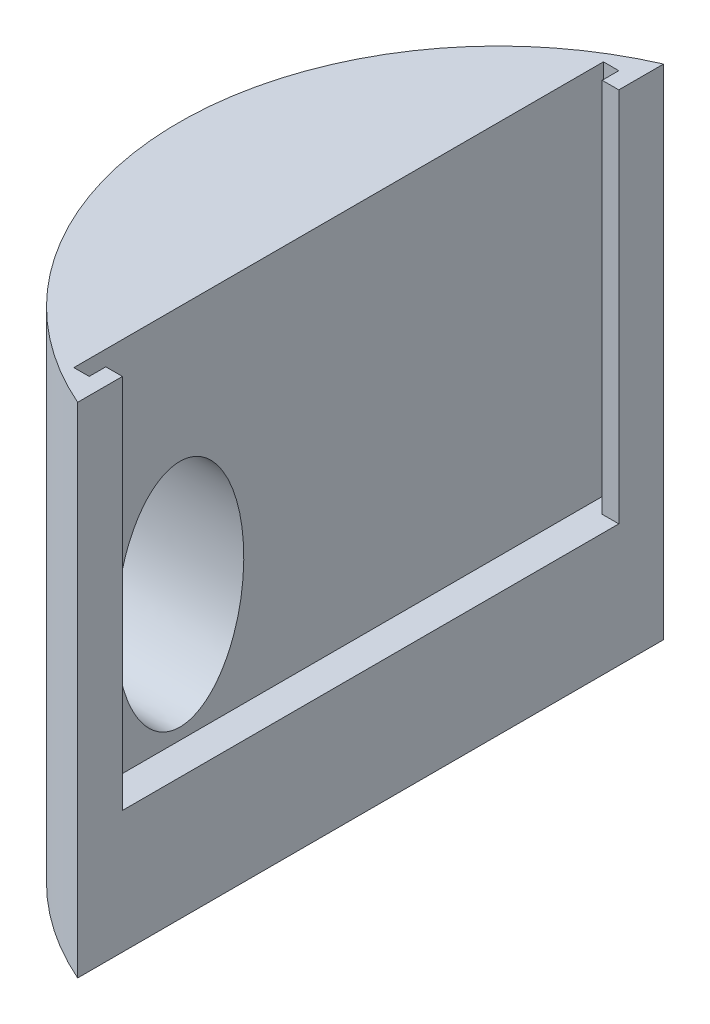
ISO-10303-21;
HEADER;
FILE_DESCRIPTION(('STEP AP214'),'2;1');
FILE_NAME('part.step','',(''),(''),'','','');
FILE_SCHEMA(('AUTOMOTIVE_DESIGN { 1 0 10303 214 1 1 1 1 }'));
ENDSEC;
DATA;
#1=APPLICATION_CONTEXT('core data for automotive mechanical design processes');
#2=APPLICATION_PROTOCOL_DEFINITION('international standard','automotive_design',2000,#1);
#3=PRODUCT_CONTEXT('',#1,'mechanical');
#4=PRODUCT('Part','Part','',(#3));
#5=PRODUCT_RELATED_PRODUCT_CATEGORY('part','',(#4));
#6=PRODUCT_DEFINITION_FORMATION('','',#4);
#7=PRODUCT_DEFINITION_CONTEXT('part definition',#1,'design');
#8=PRODUCT_DEFINITION('design','',#6,#7);
#9=PRODUCT_DEFINITION_SHAPE('','',#8);
#10=(LENGTH_UNIT() NAMED_UNIT(*) SI_UNIT(.MILLI.,.METRE.));
#11=(NAMED_UNIT(*) PLANE_ANGLE_UNIT() SI_UNIT($,.RADIAN.));
#12=(NAMED_UNIT(*) SI_UNIT($,.STERADIAN.) SOLID_ANGLE_UNIT());
#13=UNCERTAINTY_MEASURE_WITH_UNIT(LENGTH_MEASURE(1.E-05),#10,'distance_accuracy_value','');
#14=(GEOMETRIC_REPRESENTATION_CONTEXT(3) GLOBAL_UNCERTAINTY_ASSIGNED_CONTEXT((#13)) GLOBAL_UNIT_ASSIGNED_CONTEXT((#10,
#11,#12)) REPRESENTATION_CONTEXT('',''));
#15=CARTESIAN_POINT('',(0.,0.,0.));
#16=DIRECTION('',(0.,0.,1.));
#17=DIRECTION('',(1.,0.,0.));
#18=AXIS2_PLACEMENT_3D('',#15,#16,#17);
#19=CARTESIAN_POINT('',(0.,39.,0.));
#20=DIRECTION('',(0.,-1.,0.));
#21=DIRECTION('',(0.,0.,-1.));
#22=AXIS2_PLACEMENT_3D('',#19,#20,#21);
#23=CYLINDRICAL_SURFACE('',#22,25.);
#24=CARTESIAN_POINT('',(-21.696507757067,28.5,12.4202073713579));
#25=CARTESIAN_POINT('',(-21.6378187882823,28.4999980008474,12.5227286511903));
#26=CARTESIAN_POINT('',(-21.5783877609181,28.4943099357354,12.6248565797109));
#27=CARTESIAN_POINT('',(-21.4585977335974,28.4719658211142,12.8274101085213));
#28=CARTESIAN_POINT('',(-21.3982381350267,28.4553023797156,12.9278345147031));
#29=CARTESIAN_POINT('',(-21.2769843438246,28.411593803151,13.1264431854905));
#30=CARTESIAN_POINT('',(-21.2160891421624,28.3845204780868,13.2246205936252));
#31=CARTESIAN_POINT('',(-21.0943747546475,28.3207798741418,13.4179139113926));
#32=CARTESIAN_POINT('',(-21.0335556333382,28.2841070418931,13.5130280129993));
#33=CARTESIAN_POINT('',(-20.8994897760932,28.1932685773351,13.7196777894358));
#34=CARTESIAN_POINT('',(-20.826361930553,28.1370398741032,13.8303841095145));
#35=CARTESIAN_POINT('',(-20.6813988750414,28.0132363807752,14.0462332056058));
#36=CARTESIAN_POINT('',(-20.6095646181113,27.94565357616,14.1513719822238));
#37=CARTESIAN_POINT('',(-20.4676768791006,27.8006079255929,14.3558241440091));
#38=CARTESIAN_POINT('',(-20.3976232303325,27.7231460085671,14.4551380756023));
#39=CARTESIAN_POINT('',(-20.2596391668845,27.5596439049766,14.6479032493877));
#40=CARTESIAN_POINT('',(-20.1917081836966,27.4736060416039,14.7413560682177));
#41=CARTESIAN_POINT('',(-20.0293389300455,27.2552438912595,14.9616696598578));
#42=CARTESIAN_POINT('',(-19.9361206744367,27.1189750324866,15.0855315263961));
#43=CARTESIAN_POINT('',(-19.7550980428121,26.8339437155688,15.3218221360696));
#44=CARTESIAN_POINT('',(-19.6672884742755,26.6851935745737,15.4342619143233));
#45=CARTESIAN_POINT('',(-19.4774046075339,26.3410866050887,15.6735190333061));
#46=CARTESIAN_POINT('',(-19.3768037141035,26.1429715632539,15.7975393376098));
#47=CARTESIAN_POINT('',(-19.1846793865791,25.7337297066393,16.0303104338003));
#48=CARTESIAN_POINT('',(-19.0931609270075,25.5225958628731,16.1390528712815));
#49=CARTESIAN_POINT('',(-18.9198068172576,25.0900843652082,16.3419305388552));
#50=CARTESIAN_POINT('',(-18.8379563597137,24.8687231183618,16.4360881775362));
#51=CARTESIAN_POINT('',(-18.6841906341382,24.4174324578264,16.6106739179125));
#52=CARTESIAN_POINT('',(-18.6122736587743,24.1875045251974,16.6911043795487));
#53=CARTESIAN_POINT('',(-18.4120373494076,23.4874046133238,16.9126264145626));
#54=CARTESIAN_POINT('',(-18.2990394984606,23.0064316457818,17.0341699860557));
#55=CARTESIAN_POINT('',(-18.1169044820156,22.0269999112591,17.227747999727));
#56=CARTESIAN_POINT('',(-18.0477582981842,21.5285447618506,17.299792621887));
#57=CARTESIAN_POINT('',(-17.9551557320518,20.5228428509947,17.395886955321));
#58=CARTESIAN_POINT('',(-17.9316959614997,20.0155967443282,17.4199402257911));
#59=CARTESIAN_POINT('',(-17.9311790103839,19.0011253570025,17.4204702016379));
#60=CARTESIAN_POINT('',(-17.9541214211647,18.4939000761993,17.3969473260092));
#61=CARTESIAN_POINT('',(-18.0457530874644,17.4879004701569,17.3018860171019));
#62=CARTESIAN_POINT('',(-18.1144445137181,16.989126547076,17.2303453054345));
#63=CARTESIAN_POINT('',(-18.2502545438001,16.2545290544162,17.0860279123456));
#64=CARTESIAN_POINT('',(-18.3010160890141,16.011820586919,17.0317225291244));
#65=CARTESIAN_POINT('',(-18.4131528404217,15.5321050007823,16.9104312002698));
#66=CARTESIAN_POINT('',(-18.4745252670913,15.2950964075328,16.8434485750104));
#67=CARTESIAN_POINT('',(-18.6075748659457,14.8280045557541,16.6963464409418));
#68=CARTESIAN_POINT('',(-18.6792573388022,14.5979249336372,16.6162201716364));
#69=CARTESIAN_POINT('',(-18.8325503772684,14.1463217977072,16.4422777052487));
#70=CARTESIAN_POINT('',(-18.9141626660843,13.9247997777814,16.3484591314578));
#71=CARTESIAN_POINT('',(-19.0831698435691,13.5016154072819,16.1508140210901));
#72=CARTESIAN_POINT('',(-19.1701613805936,13.2995084650253,16.0475966596738));
#73=CARTESIAN_POINT('',(-19.352474689289,12.906983233545,15.8272603632247));
#74=CARTESIAN_POINT('',(-19.4477936171574,12.7165609915238,15.710146169101));
#75=CARTESIAN_POINT('',(-19.6272997134128,12.3851352855809,15.4850140117177));
#76=CARTESIAN_POINT('',(-19.7101201100227,12.241654067167,15.3795531098819));
#77=CARTESIAN_POINT('',(-19.8808006184394,11.9655136149779,15.1582758230392));
#78=CARTESIAN_POINT('',(-19.9686695131465,11.8328742772392,15.0424411824565));
#79=CARTESIAN_POINT('',(-20.1340167439129,11.601742046656,14.82016382177));
#80=CARTESIAN_POINT('',(-20.2108180871767,11.5012256849437,14.715323799786));
#81=CARTESIAN_POINT('',(-20.3672498553986,11.3110439772882,14.4980361926446));
#82=CARTESIAN_POINT('',(-20.4468811655898,11.2213820660338,14.385586216916));
#83=CARTESIAN_POINT('',(-20.6083475181497,11.0549530075212,14.1533030008128));
#84=CARTESIAN_POINT('',(-20.6901787701755,10.9781651481442,14.0334820520403));
#85=CARTESIAN_POINT('',(-20.855489359153,10.8394672448817,13.7866088849281));
#86=CARTESIAN_POINT('',(-20.9389675877648,10.7775475417096,13.6595614281103));
#87=CARTESIAN_POINT('',(-21.0781476842686,10.6889908026023,13.4432942282114));
#88=CARTESIAN_POINT('',(-21.1336412078556,10.6575161011109,13.3559034737607));
#89=CARTESIAN_POINT('',(-21.2446364091915,10.6026684750803,13.178632252699));
#90=CARTESIAN_POINT('',(-21.3001380798833,10.5792931985666,13.0887525170587));
#91=CARTESIAN_POINT('',(-21.4107426287266,10.5412489876897,12.9070292389224));
#92=CARTESIAN_POINT('',(-21.4658458141204,10.5265724304083,12.8151874891447));
#93=CARTESIAN_POINT('',(-21.5752990367632,10.5063801243437,12.6300448722459));
#94=CARTESIAN_POINT('',(-21.6296490579333,10.5008645708369,12.5367439740643));
#95=CARTESIAN_POINT('',(-21.73743018164,10.499319714217,12.3489233565856));
#96=CARTESIAN_POINT('',(-21.7908555334445,10.5033366515557,12.254399917319));
#97=CARTESIAN_POINT('',(-21.8960895994861,10.5210770375005,12.0653621076749));
#98=CARTESIAN_POINT('',(-21.9478983226334,10.5348004325995,11.9708477372503));
#99=CARTESIAN_POINT('',(-22.0495204319608,10.5718466990507,11.782618176874));
#100=CARTESIAN_POINT('',(-22.0993335644801,10.5951707865311,11.6889030897039));
#101=CARTESIAN_POINT('',(-22.1966387231604,10.6510810146188,11.50305325496));
#102=CARTESIAN_POINT('',(-22.2441307768739,10.6836670452504,11.4109184886354));
#103=CARTESIAN_POINT('',(-22.3337072392811,10.7552906912794,11.2345313235994));
#104=CARTESIAN_POINT('',(-22.3759444820373,10.7938057180252,11.1501434878656));
#105=CARTESIAN_POINT('',(-22.4580618464849,10.8779742193573,10.9838095377648));
#106=CARTESIAN_POINT('',(-22.4979412410927,10.9236298802246,10.9018641804016));
#107=CARTESIAN_POINT('',(-22.6139588598405,11.0704319155247,10.6602417251664));
#108=CARTESIAN_POINT('',(-22.6865051443099,11.1814369090611,10.5047215480108));
#109=CARTESIAN_POINT('',(-22.8055766927823,11.3948866136238,10.2430984430417));
#110=CARTESIAN_POINT('',(-22.8541416787098,11.4928587030572,10.1341693027538));
#111=CARTESIAN_POINT('',(-22.9462038423374,11.6989085788141,9.92395499009564));
#112=CARTESIAN_POINT('',(-22.9896999554918,11.8069884793826,9.82267142498833));
#113=CARTESIAN_POINT('',(-23.0720698630943,12.0316638785826,9.62760778257528));
#114=CARTESIAN_POINT('',(-23.1109355461207,12.1482737595075,9.53384096414465));
#115=CARTESIAN_POINT('',(-23.1843847075047,12.3883491134474,9.3538090384642));
#116=CARTESIAN_POINT('',(-23.2189689449795,12.5118133655161,9.2675426021766));
#117=CARTESIAN_POINT('',(-23.3025600541545,12.8350675100174,9.05593563178628));
#118=CARTESIAN_POINT('',(-23.3488182994653,13.038933117054,8.93571867531996));
#119=CARTESIAN_POINT('',(-23.4333402340361,13.4565590953264,8.71165061991655));
#120=CARTESIAN_POINT('',(-23.4716141219196,13.6703064125142,8.60777868527659));
#121=CARTESIAN_POINT('',(-23.5413781285154,14.1051089207113,8.41510472838312));
#122=CARTESIAN_POINT('',(-23.5728785736031,14.32615238635,8.32627981087773));
#123=CARTESIAN_POINT('',(-23.6301161039586,14.774028567615,8.16242218413757));
#124=CARTESIAN_POINT('',(-23.6558520490735,15.0008624186484,8.08739220391034));
#125=CARTESIAN_POINT('',(-23.7022725321323,15.4586485522528,7.95031449533294));
#126=CARTESIAN_POINT('',(-23.7229621406538,15.6895964484745,7.88825374451101));
#127=CARTESIAN_POINT('',(-23.7598951557817,16.1547331578799,7.77630060495198));
#128=CARTESIAN_POINT('',(-23.7761389564971,16.3889216818559,7.72640713766084));
#129=CARTESIAN_POINT('',(-23.8046105363389,16.8595884276305,7.63823661688308));
#130=CARTESIAN_POINT('',(-23.8168402261518,17.0960655047502,7.5999540373631));
#131=CARTESIAN_POINT('',(-23.8376127850021,17.5707431885058,7.5345465559721));
#132=CARTESIAN_POINT('',(-23.846155148737,17.8089440268173,7.50742318335639));
#133=CARTESIAN_POINT('',(-23.859765321292,18.2863630902246,7.46405477001124));
#134=CARTESIAN_POINT('',(-23.8648340615913,18.5255810252514,7.44780681298186));
#135=CARTESIAN_POINT('',(-23.8716271104851,19.0045517399559,7.42600489649111));
#136=CARTESIAN_POINT('',(-23.873351375595,19.2443045265472,7.42045107607443));
#137=CARTESIAN_POINT('',(-23.8734979979352,19.7238276057207,7.41997933889056));
#138=CARTESIAN_POINT('',(-23.8719202713885,19.9635978985928,7.42506169198097));
#139=CARTESIAN_POINT('',(-23.8654240699047,20.4426041742041,7.44591525111854));
#140=CARTESIAN_POINT('',(-23.8605059572762,20.6818402120671,7.46168529794502));
#141=CARTESIAN_POINT('',(-23.8472055674897,21.1593012484072,7.50408434715856));
#142=CARTESIAN_POINT('',(-23.8388226477726,21.3975260510643,7.5307153637339));
#143=CARTESIAN_POINT('',(-23.8183801986466,21.8723173296332,7.59512401315129));
#144=CARTESIAN_POINT('',(-23.806320612005,22.1088837796715,7.63290181950961));
#145=CARTESIAN_POINT('',(-23.7782068026301,22.5797465203665,7.7200376622029));
#146=CARTESIAN_POINT('',(-23.7621509661209,22.8140418540869,7.76940037632443));
#147=CARTESIAN_POINT('',(-23.7256201196215,23.2793911699561,7.88025129114793));
#148=CARTESIAN_POINT('',(-23.7051455522531,23.51044547429,7.94173827731551));
#149=CARTESIAN_POINT('',(-23.6591938966773,23.9684320200315,8.07760467358375));
#150=CARTESIAN_POINT('',(-23.6337132651079,24.1953612166057,8.15199321118505));
#151=CARTESIAN_POINT('',(-23.5770187182727,24.6436013771146,8.31454211349014));
#152=CARTESIAN_POINT('',(-23.5458035508157,24.8649111019466,8.40270548543226));
#153=CARTESIAN_POINT('',(-23.477834562093,25.2929443012934,8.59074823367805));
#154=CARTESIAN_POINT('',(-23.4412934260762,25.499908062455,8.69015439048562));
#155=CARTESIAN_POINT('',(-23.3609529607925,25.9044093697735,8.90387110438175));
#156=CARTESIAN_POINT('',(-23.3171597876107,26.1019547293622,9.01816900282031));
#157=CARTESIAN_POINT('',(-23.2334034218981,26.4354689704245,9.2313851329657));
#158=CARTESIAN_POINT('',(-23.1953481057031,26.5742160048898,9.32670740599468));
#159=CARTESIAN_POINT('',(-23.1138726636993,26.8434764635876,9.52683527938608));
#160=CARTESIAN_POINT('',(-23.0704439460719,26.9739761840852,9.63165599379908));
#161=CARTESIAN_POINT('',(-22.9853655201715,27.2036545829663,9.83274246612505));
#162=CARTESIAN_POINT('',(-22.9446128504242,27.3044406417791,9.92754897490028));
#163=CARTESIAN_POINT('',(-22.8586475857284,27.4972610755869,10.1239181389583));
#164=CARTESIAN_POINT('',(-22.8134337997531,27.5892931004832,10.2254825961056));
#165=CARTESIAN_POINT('',(-22.7183502520225,27.7628316237302,10.4350266204663));
#166=CARTESIAN_POINT('',(-22.6684860299965,27.8443503766582,10.542998500573));
#167=CARTESIAN_POINT('',(-22.5639326106008,27.9951880466139,10.7649414268911));
#168=CARTESIAN_POINT('',(-22.5092460028251,28.0645134522232,10.8789092402155));
#169=CARTESIAN_POINT('',(-22.4109914201859,28.1718771581846,11.0795416562326));
#170=CARTESIAN_POINT('',(-22.3685601228087,28.2132550556888,11.1649863114206));
#171=CARTESIAN_POINT('',(-22.2813256991546,28.2881488719093,11.3380733936584));
#172=CARTESIAN_POINT('',(-22.2365231439791,28.3216666732102,11.4257152888658));
#173=CARTESIAN_POINT('',(-22.1448135789136,28.3802873881663,11.6024620320843));
#174=CARTESIAN_POINT('',(-22.0979108596061,28.4054066434866,11.6915636809841));
#175=CARTESIAN_POINT('',(-22.0021899242331,28.4469617316005,11.8707178482609));
#176=CARTESIAN_POINT('',(-21.953372585364,28.4634014921722,11.9607699176879));
#177=CARTESIAN_POINT('',(-21.8698861580622,28.4836304192881,12.1125151498294));
#178=CARTESIAN_POINT('',(-21.8356436360884,28.4897785959146,12.1741386565154));
#179=CARTESIAN_POINT('',(-21.7665252932802,28.497963724511,12.2972909023496));
#180=CARTESIAN_POINT('',(-21.7316495531999,28.5000011970531,12.3588196525112));
#181=CARTESIAN_POINT('',(-21.696507757067,28.5,12.4202073713579));
#182=B_SPLINE_CURVE_WITH_KNOTS('',3,(#24,#25,#26,#27,#28,#29,#30,#31,#32,#33,#34,#35,#36,#37,
#38,#39,#40,#41,#42,#43,#44,#45,#46,#47,#48,#49,#50,#51,#52,#53,#54,#55,#56,#57,#58,#59,#60,#61,
#62,#63,#64,#65,#66,#67,#68,#69,#70,#71,#72,#73,#74,#75,#76,#77,#78,#79,#80,#81,#82,#83,#84,#85,
#86,#87,#88,#89,#90,#91,#92,#93,#94,#95,#96,#97,#98,#99,#100,#101,#102,#103,#104,#105,#106,#107,
#108,#109,#110,#111,#112,#113,#114,#115,#116,#117,#118,#119,#120,#121,#122,#123,#124,#125,#126,
#127,#128,#129,#130,#131,#132,#133,#134,#135,#136,#137,#138,#139,#140,#141,#142,#143,#144,#145,
#146,#147,#148,#149,#150,#151,#152,#153,#154,#155,#156,#157,#158,#159,#160,#161,#162,#163,#164,
#165,#166,#167,#168,#169,#170,#171,#172,#173,#174,#175,#176,#177,#178,#179,#180,#181),
.UNSPECIFIED.,.T.,.F.,(4,2,2,2,2,2,2,2,2,2,2,2,2,2,2,2,2,2,2,2,2,2,2,2,2,2,2,2,2,2,2,2,2,2,2,2,
2,2,2,2,2,2,2,2,2,2,2,2,2,2,2,2,2,2,2,2,2,2,2,2,2,2,2,2,2,2,2,2,2,2,2,2,2,2,2,2,2,2,4),(0.,
0.354310856387852,0.708860584625958,1.06437727117574,1.42010008237744,1.8517674474684,
2.28374080374677,2.71567357178044,3.14748964720573,3.76576451430117,4.38343625571107,
5.14571799302659,5.9084149603347,6.6699282149486,7.4313104200017,8.95238989338453,
10.4731564469866,11.9938102113582,13.5144505836656,15.0351631136378,15.7961854952945,
16.5570088280759,17.3182247281592,18.0795729174984,18.8079576330687,19.536094570524,
20.1247088395704,20.7143801008063,21.2067808260987,21.6993369574178,22.1910928847018,
22.6825284668565,23.0068382615714,23.3310538015819,23.6549848012156,23.9789227056893,
24.3044351860638,24.6299458720557,24.9554978034663,25.2810458694564,25.586492873783,
25.8920335819792,26.5029138140652,26.9653765809714,27.4279362982256,27.8912947542441,
28.3545709369445,29.0768941985302,29.7982890911317,30.5185762668851,31.2390057817476,
31.9587083963568,32.6783471905944,33.3976429437904,34.1170372363153,34.8362385421068,
35.5554491988585,36.2746781034149,36.9938290106379,37.7131133465071,38.4324088796912,
39.1519953532678,39.8715097797194,40.591535335351,41.3117183028043,42.008523118705,
42.7047394371951,43.2220398629476,43.7401783844087,44.1724851731441,44.604907692875,
45.0368215228092,45.4685048136399,45.7801520063792,46.0917244795789,46.4026871265324,
46.7135089310167,46.9256901505376,47.1378444981209),.UNSPECIFIED.);
#183=CARTESIAN_POINT('',(-21.696507757067,28.5,12.4202073713579));
#184=VERTEX_POINT('',#183);
#185=EDGE_CURVE('E134',#184,#184,#182,.T.);
#186=ORIENTED_EDGE('',*,*,#185,.T.);
#187=EDGE_LOOP('',(#186));
#188=FACE_BOUND('',#187,.T.);
#189=CARTESIAN_POINT('',(0.,0.,0.));
#190=DIRECTION('',(0.,1.,0.));
#191=DIRECTION('',(0.,0.,1.));
#192=AXIS2_PLACEMENT_3D('',#189,#190,#191);
#193=CIRCLE('',#192,25.);
#194=CARTESIAN_POINT('',(-9.99999999999999,0.,-22.9128784747792));
#195=VERTEX_POINT('',#194);
#196=CARTESIAN_POINT('',(-9.99999999999999,0.,22.9128784747792));
#197=VERTEX_POINT('',#196);
#198=EDGE_CURVE('E80',#195,#197,#193,.T.);
#199=ORIENTED_EDGE('',*,*,#198,.T.);
#200=DIRECTION('',(0.,-1.,0.));
#201=VECTOR('',#200,1.);
#202=CARTESIAN_POINT('',(-9.99999999999999,39.,22.9128784747792));
#203=LINE('',#202,#201);
#204=CARTESIAN_POINT('',(-9.99999999999999,39.,22.9128784747792));
#205=VERTEX_POINT('',#204);
#206=EDGE_CURVE('E11',#205,#197,#203,.T.);
#207=ORIENTED_EDGE('',*,*,#206,.F.);
#208=CARTESIAN_POINT('',(0.,39.,0.));
#209=DIRECTION('',(0.,1.,0.));
#210=DIRECTION('',(0.,0.,1.));
#211=AXIS2_PLACEMENT_3D('',#208,#209,#210);
#212=CIRCLE('',#211,25.);
#213=CARTESIAN_POINT('',(-9.99999999999999,39.,-22.9128784747792));
#214=VERTEX_POINT('',#213);
#215=EDGE_CURVE('E79',#214,#205,#212,.T.);
#216=ORIENTED_EDGE('',*,*,#215,.F.);
#217=DIRECTION('',(0.,-1.,0.));
#218=VECTOR('',#217,1.);
#219=CARTESIAN_POINT('',(-9.99999999999999,39.,-22.9128784747792));
#220=LINE('',#219,#218);
#221=EDGE_CURVE('E43',#214,#195,#220,.T.);
#222=ORIENTED_EDGE('',*,*,#221,.T.);
#223=EDGE_LOOP('',(#199,#207,#216,#222));
#224=FACE_BOUND('',#223,.T.);
#225=ADVANCED_FACE('F34',(#188,#224),#23,.T.);
#226=CARTESIAN_POINT('',(-9.99999999999999,39.,-22.9128784747792));
#227=DIRECTION('',(-1.,0.,0.));
#228=DIRECTION('',(0.,0.,1.));
#229=AXIS2_PLACEMENT_3D('',#226,#227,#228);
#230=PLANE('',#229);
#231=DIRECTION('',(0.,0.,-1.));
#232=VECTOR('',#231,1.);
#233=CARTESIAN_POINT('',(-9.99999999999999,39.,-22.9128784747792));
#234=LINE('',#233,#232);
#235=CARTESIAN_POINT('',(-9.99999999999999,39.,-19.4128784747792));
#236=VERTEX_POINT('',#235);
#237=EDGE_CURVE('E59',#236,#214,#234,.T.);
#238=ORIENTED_EDGE('',*,*,#237,.F.);
#239=DIRECTION('',(0.,1.,0.));
#240=VECTOR('',#239,1.);
#241=CARTESIAN_POINT('',(-9.99999999999999,9.6,-19.4128784747792));
#242=LINE('',#241,#240);
#243=CARTESIAN_POINT('',(-9.99999999999999,9.6,-19.4128784747792));
#244=VERTEX_POINT('',#243);
#245=EDGE_CURVE('E109',#244,#236,#242,.T.);
#246=ORIENTED_EDGE('',*,*,#245,.F.);
#247=DIRECTION('',(0.,0.,-1.));
#248=VECTOR('',#247,1.);
#249=CARTESIAN_POINT('',(-9.99999999999999,9.6,19.4128784747792));
#250=LINE('',#249,#248);
#251=CARTESIAN_POINT('',(-9.99999999999999,9.6,19.4128784747792));
#252=VERTEX_POINT('',#251);
#253=EDGE_CURVE('E140',#252,#244,#250,.T.);
#254=ORIENTED_EDGE('',*,*,#253,.F.);
#255=DIRECTION('',(0.,1.,0.));
#256=VECTOR('',#255,1.);
#257=CARTESIAN_POINT('',(-9.99999999999999,9.6,19.4128784747792));
#258=LINE('',#257,#256);
#259=CARTESIAN_POINT('',(-9.99999999999999,39.,19.4128784747792));
#260=VERTEX_POINT('',#259);
#261=EDGE_CURVE('E106',#252,#260,#258,.T.);
#262=ORIENTED_EDGE('',*,*,#261,.T.);
#263=EDGE_CURVE('E83',#205,#260,#234,.T.);
#264=ORIENTED_EDGE('',*,*,#263,.F.);
#265=ORIENTED_EDGE('',*,*,#206,.T.);
#266=DIRECTION('',(0.,0.,-1.));
#267=VECTOR('',#266,1.);
#268=CARTESIAN_POINT('',(-9.99999999999999,0.,-22.9128784747792));
#269=LINE('',#268,#267);
#270=EDGE_CURVE('E71',#197,#195,#269,.T.);
#271=ORIENTED_EDGE('',*,*,#270,.T.);
#272=ORIENTED_EDGE('',*,*,#221,.F.);
#273=EDGE_LOOP('',(#238,#246,#254,#262,#264,#265,#271,#272));
#274=FACE_BOUND('',#273,.T.);
#275=ADVANCED_FACE('F73',(#274),#230,.F.);
#276=CARTESIAN_POINT('',(0.,39.,0.));
#277=DIRECTION('',(0.,1.,0.));
#278=DIRECTION('',(0.,0.,1.));
#279=AXIS2_PLACEMENT_3D('',#276,#277,#278);
#280=PLANE('',#279);
#281=DIRECTION('',(-1.,0.,0.));
#282=VECTOR('',#281,1.);
#283=CARTESIAN_POINT('',(-9.99999999999999,39.,-19.4128784747792));
#284=LINE('',#283,#282);
#285=CARTESIAN_POINT('',(-11.3,39.,-19.4128784747792));
#286=VERTEX_POINT('',#285);
#287=EDGE_CURVE('E118',#236,#286,#284,.T.);
#288=ORIENTED_EDGE('',*,*,#287,.F.);
#289=ORIENTED_EDGE('',*,*,#237,.T.);
#290=ORIENTED_EDGE('',*,*,#215,.T.);
#291=ORIENTED_EDGE('',*,*,#263,.T.);
#292=DIRECTION('',(1.,0.,0.));
#293=VECTOR('',#292,1.);
#294=CARTESIAN_POINT('',(-11.3,39.,19.4128784747792));
#295=LINE('',#294,#293);
#296=CARTESIAN_POINT('',(-11.3,39.,19.4128784747792));
#297=VERTEX_POINT('',#296);
#298=EDGE_CURVE('E121',#297,#260,#295,.T.);
#299=ORIENTED_EDGE('',*,*,#298,.F.);
#300=DIRECTION('',(0.,0.,-1.));
#301=VECTOR('',#300,1.);
#302=CARTESIAN_POINT('',(-11.3,39.,20.7128784747792));
#303=LINE('',#302,#301);
#304=CARTESIAN_POINT('',(-11.3,39.,20.7128784747792));
#305=VERTEX_POINT('',#304);
#306=EDGE_CURVE('E124',#305,#297,#303,.T.);
#307=ORIENTED_EDGE('',*,*,#306,.F.);
#308=DIRECTION('',(1.,0.,0.));
#309=VECTOR('',#308,1.);
#310=CARTESIAN_POINT('',(-12.5,39.,20.7128784747792));
#311=LINE('',#310,#309);
#312=CARTESIAN_POINT('',(-12.5,39.,20.7128784747792));
#313=VERTEX_POINT('',#312);
#314=EDGE_CURVE('E127',#313,#305,#311,.T.);
#315=ORIENTED_EDGE('',*,*,#314,.F.);
#316=DIRECTION('',(0.,0.,1.));
#317=VECTOR('',#316,1.);
#318=CARTESIAN_POINT('',(-12.5,39.,20.7128784747792));
#319=LINE('',#318,#317);
#320=CARTESIAN_POINT('',(-12.5,39.,-20.7128784747792));
#321=VERTEX_POINT('',#320);
#322=EDGE_CURVE('E130',#321,#313,#319,.T.);
#323=ORIENTED_EDGE('',*,*,#322,.F.);
#324=DIRECTION('',(-1.,0.,0.));
#325=VECTOR('',#324,1.);
#326=CARTESIAN_POINT('',(-11.3,39.,-20.7128784747792));
#327=LINE('',#326,#325);
#328=CARTESIAN_POINT('',(-11.3,39.,-20.7128784747792));
#329=VERTEX_POINT('',#328);
#330=EDGE_CURVE('E50',#329,#321,#327,.T.);
#331=ORIENTED_EDGE('',*,*,#330,.F.);
#332=DIRECTION('',(0.,0.,-1.));
#333=VECTOR('',#332,1.);
#334=CARTESIAN_POINT('',(-11.3,39.,-19.4128784747792));
#335=LINE('',#334,#333);
#336=EDGE_CURVE('E114',#286,#329,#335,.T.);
#337=ORIENTED_EDGE('',*,*,#336,.F.);
#338=EDGE_LOOP('',(#288,#289,#290,#291,#299,#307,#315,#323,#331,#337));
#339=FACE_BOUND('',#338,.T.);
#340=ADVANCED_FACE('F199',(#339),#280,.T.);
#341=CARTESIAN_POINT('',(0.,0.,0.));
#342=DIRECTION('',(0.,1.,0.));
#343=DIRECTION('',(0.,0.,1.));
#344=AXIS2_PLACEMENT_3D('',#341,#342,#343);
#345=PLANE('',#344);
#346=ORIENTED_EDGE('',*,*,#198,.F.);
#347=ORIENTED_EDGE('',*,*,#270,.F.);
#348=EDGE_LOOP('',(#346,#347));
#349=FACE_BOUND('',#348,.T.);
#350=ADVANCED_FACE('F85',(#349),#345,.F.);
#351=CARTESIAN_POINT('',(-11.3,9.6,-20.7128784747792));
#352=DIRECTION('',(0.,0.,-1.));
#353=DIRECTION('',(-1.,0.,0.));
#354=AXIS2_PLACEMENT_3D('',#351,#352,#353);
#355=PLANE('',#354);
#356=ORIENTED_EDGE('',*,*,#330,.T.);
#357=DIRECTION('',(0.,1.,0.));
#358=VECTOR('',#357,1.);
#359=CARTESIAN_POINT('',(-12.5,9.6,-20.7128784747792));
#360=LINE('',#359,#358);
#361=CARTESIAN_POINT('',(-12.5,9.6,-20.7128784747792));
#362=VERTEX_POINT('',#361);
#363=EDGE_CURVE('E94',#362,#321,#360,.T.);
#364=ORIENTED_EDGE('',*,*,#363,.F.);
#365=DIRECTION('',(-1.,0.,0.));
#366=VECTOR('',#365,1.);
#367=CARTESIAN_POINT('',(-11.3,9.6,-20.7128784747792));
#368=LINE('',#367,#366);
#369=CARTESIAN_POINT('',(-11.3,9.6,-20.7128784747792));
#370=VERTEX_POINT('',#369);
#371=EDGE_CURVE('E117',#370,#362,#368,.T.);
#372=ORIENTED_EDGE('',*,*,#371,.F.);
#373=DIRECTION('',(0.,1.,0.));
#374=VECTOR('',#373,1.);
#375=CARTESIAN_POINT('',(-11.3,9.6,-20.7128784747792));
#376=LINE('',#375,#374);
#377=EDGE_CURVE('E86',#370,#329,#376,.T.);
#378=ORIENTED_EDGE('',*,*,#377,.T.);
#379=EDGE_LOOP('',(#356,#364,#372,#378));
#380=FACE_BOUND('',#379,.T.);
#381=ADVANCED_FACE('F177',(#380),#355,.F.);
#382=CARTESIAN_POINT('',(-11.3,9.6,-19.4128784747792));
#383=DIRECTION('',(1.,0.,0.));
#384=DIRECTION('',(0.,0.,-1.));
#385=AXIS2_PLACEMENT_3D('',#382,#383,#384);
#386=PLANE('',#385);
#387=ORIENTED_EDGE('',*,*,#336,.T.);
#388=ORIENTED_EDGE('',*,*,#377,.F.);
#389=DIRECTION('',(0.,0.,-1.));
#390=VECTOR('',#389,1.);
#391=CARTESIAN_POINT('',(-11.3,9.6,-19.4128784747792));
#392=LINE('',#391,#390);
#393=CARTESIAN_POINT('',(-11.3,9.6,-19.4128784747792));
#394=VERTEX_POINT('',#393);
#395=EDGE_CURVE('E97',#394,#370,#392,.T.);
#396=ORIENTED_EDGE('',*,*,#395,.F.);
#397=DIRECTION('',(0.,1.,0.));
#398=VECTOR('',#397,1.);
#399=CARTESIAN_POINT('',(-11.3,9.6,-19.4128784747792));
#400=LINE('',#399,#398);
#401=EDGE_CURVE('E88',#394,#286,#400,.T.);
#402=ORIENTED_EDGE('',*,*,#401,.T.);
#403=EDGE_LOOP('',(#387,#388,#396,#402));
#404=FACE_BOUND('',#403,.T.);
#405=ADVANCED_FACE('F173',(#404),#386,.F.);
#406=CARTESIAN_POINT('',(-9.99999999999999,9.6,-19.4128784747792));
#407=DIRECTION('',(0.,0.,-1.));
#408=DIRECTION('',(-1.,0.,0.));
#409=AXIS2_PLACEMENT_3D('',#406,#407,#408);
#410=PLANE('',#409);
#411=ORIENTED_EDGE('',*,*,#287,.T.);
#412=ORIENTED_EDGE('',*,*,#401,.F.);
#413=DIRECTION('',(-1.,0.,0.));
#414=VECTOR('',#413,1.);
#415=CARTESIAN_POINT('',(-9.99999999999999,9.6,-19.4128784747792));
#416=LINE('',#415,#414);
#417=EDGE_CURVE('E137',#244,#394,#416,.T.);
#418=ORIENTED_EDGE('',*,*,#417,.F.);
#419=ORIENTED_EDGE('',*,*,#245,.T.);
#420=EDGE_LOOP('',(#411,#412,#418,#419));
#421=FACE_BOUND('',#420,.T.);
#422=ADVANCED_FACE('F176',(#421),#410,.F.);
#423=CARTESIAN_POINT('',(-11.3,9.6,19.4128784747792));
#424=DIRECTION('',(0.,0.,1.));
#425=DIRECTION('',(1.,0.,0.));
#426=AXIS2_PLACEMENT_3D('',#423,#424,#425);
#427=PLANE('',#426);
#428=ORIENTED_EDGE('',*,*,#298,.T.);
#429=ORIENTED_EDGE('',*,*,#261,.F.);
#430=DIRECTION('',(1.,0.,0.));
#431=VECTOR('',#430,1.);
#432=CARTESIAN_POINT('',(-11.3,9.6,19.4128784747792));
#433=LINE('',#432,#431);
#434=CARTESIAN_POINT('',(-11.3,9.6,19.4128784747792));
#435=VERTEX_POINT('',#434);
#436=EDGE_CURVE('E143',#435,#252,#433,.T.);
#437=ORIENTED_EDGE('',*,*,#436,.F.);
#438=DIRECTION('',(0.,1.,0.));
#439=VECTOR('',#438,1.);
#440=CARTESIAN_POINT('',(-11.3,9.6,19.4128784747792));
#441=LINE('',#440,#439);
#442=EDGE_CURVE('E103',#435,#297,#441,.T.);
#443=ORIENTED_EDGE('',*,*,#442,.T.);
#444=EDGE_LOOP('',(#428,#429,#437,#443));
#445=FACE_BOUND('',#444,.T.);
#446=ADVANCED_FACE('F181',(#445),#427,.F.);
#447=CARTESIAN_POINT('',(-11.3,9.6,20.7128784747792));
#448=DIRECTION('',(1.,0.,0.));
#449=DIRECTION('',(0.,0.,-1.));
#450=AXIS2_PLACEMENT_3D('',#447,#448,#449);
#451=PLANE('',#450);
#452=ORIENTED_EDGE('',*,*,#306,.T.);
#453=ORIENTED_EDGE('',*,*,#442,.F.);
#454=DIRECTION('',(0.,0.,-1.));
#455=VECTOR('',#454,1.);
#456=CARTESIAN_POINT('',(-11.3,9.6,20.7128784747792));
#457=LINE('',#456,#455);
#458=CARTESIAN_POINT('',(-11.3,9.6,20.7128784747792));
#459=VERTEX_POINT('',#458);
#460=EDGE_CURVE('E146',#459,#435,#457,.T.);
#461=ORIENTED_EDGE('',*,*,#460,.F.);
#462=DIRECTION('',(0.,1.,0.));
#463=VECTOR('',#462,1.);
#464=CARTESIAN_POINT('',(-11.3,9.6,20.7128784747792));
#465=LINE('',#464,#463);
#466=EDGE_CURVE('E100',#459,#305,#465,.T.);
#467=ORIENTED_EDGE('',*,*,#466,.T.);
#468=EDGE_LOOP('',(#452,#453,#461,#467));
#469=FACE_BOUND('',#468,.T.);
#470=ADVANCED_FACE('F185',(#469),#451,.F.);
#471=CARTESIAN_POINT('',(-12.5,9.6,20.7128784747792));
#472=DIRECTION('',(0.,0.,1.));
#473=DIRECTION('',(1.,0.,0.));
#474=AXIS2_PLACEMENT_3D('',#471,#472,#473);
#475=PLANE('',#474);
#476=ORIENTED_EDGE('',*,*,#314,.T.);
#477=ORIENTED_EDGE('',*,*,#466,.F.);
#478=DIRECTION('',(1.,0.,0.));
#479=VECTOR('',#478,1.);
#480=CARTESIAN_POINT('',(-12.5,9.6,20.7128784747792));
#481=LINE('',#480,#479);
#482=CARTESIAN_POINT('',(-12.5,9.6,20.7128784747792));
#483=VERTEX_POINT('',#482);
#484=EDGE_CURVE('E149',#483,#459,#481,.T.);
#485=ORIENTED_EDGE('',*,*,#484,.F.);
#486=DIRECTION('',(0.,1.,0.));
#487=VECTOR('',#486,1.);
#488=CARTESIAN_POINT('',(-12.5,9.6,20.7128784747792));
#489=LINE('',#488,#487);
#490=EDGE_CURVE('E96',#483,#313,#489,.T.);
#491=ORIENTED_EDGE('',*,*,#490,.T.);
#492=EDGE_LOOP('',(#476,#477,#485,#491));
#493=FACE_BOUND('',#492,.T.);
#494=ADVANCED_FACE('F189',(#493),#475,.F.);
#495=CARTESIAN_POINT('',(-12.5,9.6,20.7128784747792));
#496=DIRECTION('',(-1.,0.,0.));
#497=DIRECTION('',(0.,0.,1.));
#498=AXIS2_PLACEMENT_3D('',#495,#496,#497);
#499=PLANE('',#498);
#500=CARTESIAN_POINT('',(-12.5,19.5,12.4202073713579));
#501=DIRECTION('',(1.,0.,0.));
#502=DIRECTION('',(0.,1.,0.));
#503=AXIS2_PLACEMENT_3D('',#500,#501,#502);
#504=ELLIPSE('',#503,9.,5.);
#505=CARTESIAN_POINT('',(-12.5,28.5,12.4202073713579));
#506=VERTEX_POINT('',#505);
#507=EDGE_CURVE('E38',#506,#506,#504,.F.);
#508=ORIENTED_EDGE('',*,*,#507,.T.);
#509=EDGE_LOOP('',(#508));
#510=FACE_BOUND('',#509,.T.);
#511=ORIENTED_EDGE('',*,*,#322,.T.);
#512=ORIENTED_EDGE('',*,*,#490,.F.);
#513=DIRECTION('',(0.,0.,1.));
#514=VECTOR('',#513,1.);
#515=CARTESIAN_POINT('',(-12.5,9.6,20.7128784747792));
#516=LINE('',#515,#514);
#517=EDGE_CURVE('E152',#362,#483,#516,.T.);
#518=ORIENTED_EDGE('',*,*,#517,.F.);
#519=ORIENTED_EDGE('',*,*,#363,.T.);
#520=EDGE_LOOP('',(#511,#512,#518,#519));
#521=FACE_BOUND('',#520,.T.);
#522=ADVANCED_FACE('F171',(#510,#521),#499,.F.);
#523=CARTESIAN_POINT('',(0.,9.6,0.));
#524=DIRECTION('',(0.,-1.,0.));
#525=DIRECTION('',(0.,0.,-1.));
#526=AXIS2_PLACEMENT_3D('',#523,#524,#525);
#527=PLANE('',#526);
#528=ORIENTED_EDGE('',*,*,#371,.T.);
#529=ORIENTED_EDGE('',*,*,#517,.T.);
#530=ORIENTED_EDGE('',*,*,#484,.T.);
#531=ORIENTED_EDGE('',*,*,#460,.T.);
#532=ORIENTED_EDGE('',*,*,#436,.T.);
#533=ORIENTED_EDGE('',*,*,#253,.T.);
#534=ORIENTED_EDGE('',*,*,#417,.T.);
#535=ORIENTED_EDGE('',*,*,#395,.T.);
#536=EDGE_LOOP('',(#528,#529,#530,#531,#532,#533,#534,#535));
#537=FACE_BOUND('',#536,.T.);
#538=ADVANCED_FACE('F167',(#537),#527,.F.);
#539=CARTESIAN_POINT('',(-25.,19.5,12.4202073713579));
#540=DIRECTION('',(1.,0.,0.));
#541=DIRECTION('',(0.,1.,0.));
#542=AXIS2_PLACEMENT_3D('',#539,#540,#541);
#543=ELLIPSE('',#542,9.,5.);
#544=DIRECTION('',(1.,0.,0.));
#545=VECTOR('',#544,1.);
#546=SURFACE_OF_LINEAR_EXTRUSION('',#543,#545);
#547=ORIENTED_EDGE('',*,*,#507,.F.);
#548=EDGE_LOOP('',(#547));
#549=FACE_BOUND('',#548,.T.);
#550=ORIENTED_EDGE('',*,*,#185,.F.);
#551=EDGE_LOOP('',(#550));
#552=FACE_BOUND('',#551,.T.);
#553=ADVANCED_FACE('F163',(#549,#552),#546,.F.);
#554=CLOSED_SHELL('',(#225,#275,#340,#350,#381,#405,#422,#446,#470,#494,#522,#538,#553));
#555=MANIFOLD_SOLID_BREP('B2',#554);
#556=ADVANCED_BREP_SHAPE_REPRESENTATION('',(#18,#555),#14);
#557=SHAPE_DEFINITION_REPRESENTATION(#9,#556);
ENDSEC;
END-ISO-10303-21;
